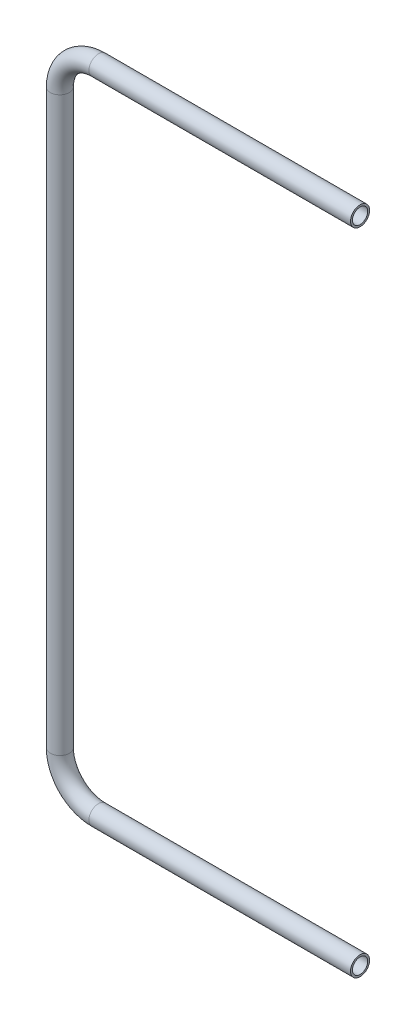
ISO-10303-21;
HEADER;
FILE_DESCRIPTION(('STEP AP214'),'2;1');
FILE_NAME('part.step','',(''),(''),'','','');
FILE_SCHEMA(('AUTOMOTIVE_DESIGN { 1 0 10303 214 1 1 1 1 }'));
ENDSEC;
DATA;
#1=APPLICATION_CONTEXT('core data for automotive mechanical design processes');
#2=APPLICATION_PROTOCOL_DEFINITION('international standard','automotive_design',2000,#1);
#3=PRODUCT_CONTEXT('',#1,'mechanical');
#4=PRODUCT('Part','Part','',(#3));
#5=PRODUCT_RELATED_PRODUCT_CATEGORY('part','',(#4));
#6=PRODUCT_DEFINITION_FORMATION('','',#4);
#7=PRODUCT_DEFINITION_CONTEXT('part definition',#1,'design');
#8=PRODUCT_DEFINITION('design','',#6,#7);
#9=PRODUCT_DEFINITION_SHAPE('','',#8);
#10=(LENGTH_UNIT() NAMED_UNIT(*) SI_UNIT(.MILLI.,.METRE.));
#11=(NAMED_UNIT(*) PLANE_ANGLE_UNIT() SI_UNIT($,.RADIAN.));
#12=(NAMED_UNIT(*) SI_UNIT($,.STERADIAN.) SOLID_ANGLE_UNIT());
#13=UNCERTAINTY_MEASURE_WITH_UNIT(LENGTH_MEASURE(1.E-05),#10,'distance_accuracy_value','');
#14=(GEOMETRIC_REPRESENTATION_CONTEXT(3) GLOBAL_UNCERTAINTY_ASSIGNED_CONTEXT((#13)) GLOBAL_UNIT_ASSIGNED_CONTEXT((#10,
#11,#12)) REPRESENTATION_CONTEXT('',''));
#15=CARTESIAN_POINT('',(0.,0.,0.));
#16=DIRECTION('',(0.,0.,1.));
#17=DIRECTION('',(1.,0.,0.));
#18=AXIS2_PLACEMENT_3D('',#15,#16,#17);
#19=CARTESIAN_POINT('',(0.,0.,0.));
#20=DIRECTION('',(-1.,0.,0.));
#21=DIRECTION('',(0.,-1.,0.));
#22=AXIS2_PLACEMENT_3D('',#19,#20,#21);
#23=CYLINDRICAL_SURFACE('',#22,16.7005);
#24=CARTESIAN_POINT('',(-457.2,0.,0.));
#25=DIRECTION('',(1.,0.,0.));
#26=DIRECTION('',(0.,0.,-1.));
#27=AXIS2_PLACEMENT_3D('',#24,#25,#26);
#28=CIRCLE('',#27,16.7005);
#29=CARTESIAN_POINT('',(-457.2,-16.7005000000001,0.));
#30=VERTEX_POINT('',#29);
#31=EDGE_CURVE('E118',#30,#30,#28,.T.);
#32=ORIENTED_EDGE('',*,*,#31,.T.);
#33=EDGE_LOOP('',(#32));
#34=FACE_BOUND('',#33,.T.);
#35=CARTESIAN_POINT('',(0.,0.,0.));
#36=DIRECTION('',(1.,0.,0.));
#37=DIRECTION('',(0.,0.,-1.));
#38=AXIS2_PLACEMENT_3D('',#35,#36,#37);
#39=CIRCLE('',#38,16.7005);
#40=CARTESIAN_POINT('',(0.,0.,-16.7005));
#41=VERTEX_POINT('',#40);
#42=EDGE_CURVE('E52',#41,#41,#39,.T.);
#43=ORIENTED_EDGE('',*,*,#42,.F.);
#44=EDGE_LOOP('',(#43));
#45=FACE_BOUND('',#44,.T.);
#46=ADVANCED_FACE('F37',(#34,#45),#23,.T.);
#47=CARTESIAN_POINT('',(-457.2,67.5004999999999,0.));
#48=DIRECTION('',(0.,0.,-1.));
#49=DIRECTION('',(-1.,0.,0.));
#50=AXIS2_PLACEMENT_3D('',#47,#48,#49);
#51=TOROIDAL_SURFACE('',#50,67.5005,16.7005);
#52=CARTESIAN_POINT('',(-524.7005,67.5004999999999,0.));
#53=DIRECTION('',(0.,-1.,0.));
#54=DIRECTION('',(0.,0.,-1.));
#55=AXIS2_PLACEMENT_3D('',#52,#53,#54);
#56=CIRCLE('',#55,16.7005);
#57=CARTESIAN_POINT('',(-541.401,67.5004999999999,0.));
#58=VERTEX_POINT('',#57);
#59=EDGE_CURVE('E121',#58,#58,#56,.T.);
#60=CARTESIAN_POINT('',(-457.2,67.5004999999999,0.));
#61=DIRECTION('',(0.,0.,-1.));
#62=DIRECTION('',(-1.,0.,0.));
#63=AXIS2_PLACEMENT_3D('',#60,#61,#62);
#64=CIRCLE('',#63,84.201);
#65=EDGE_CURVE('',#30,#58,#64,.T.);
#66=ORIENTED_EDGE('',*,*,#31,.F.);
#67=ORIENTED_EDGE('',*,*,#59,.T.);
#68=ORIENTED_EDGE('',*,*,#65,.T.);
#69=ORIENTED_EDGE('',*,*,#65,.F.);
#70=EDGE_LOOP('',(#66,#68,#67,#69));
#71=FACE_BOUND('',#70,.T.);
#72=ADVANCED_FACE('F142',(#71),#51,.T.);
#73=CARTESIAN_POINT('',(-524.7005,67.5004999999999,0.));
#74=DIRECTION('',(0.,1.,0.));
#75=DIRECTION('',(-1.,0.,0.));
#76=AXIS2_PLACEMENT_3D('',#73,#74,#75);
#77=CYLINDRICAL_SURFACE('',#76,16.7005);
#78=CARTESIAN_POINT('',(-524.7005,1067.562,0.));
#79=DIRECTION('',(0.,-1.,0.));
#80=DIRECTION('',(0.,0.,-1.));
#81=AXIS2_PLACEMENT_3D('',#78,#79,#80);
#82=CIRCLE('',#81,16.7005);
#83=CARTESIAN_POINT('',(-541.401,1067.562,0.));
#84=VERTEX_POINT('',#83);
#85=EDGE_CURVE('E123',#84,#84,#82,.T.);
#86=ORIENTED_EDGE('',*,*,#85,.T.);
#87=EDGE_LOOP('',(#86));
#88=FACE_BOUND('',#87,.T.);
#89=ORIENTED_EDGE('',*,*,#59,.F.);
#90=EDGE_LOOP('',(#89));
#91=FACE_BOUND('',#90,.T.);
#92=ADVANCED_FACE('F138',(#88,#91),#77,.T.);
#93=CARTESIAN_POINT('',(-457.2,1067.562,0.));
#94=DIRECTION('',(0.,0.,-1.));
#95=DIRECTION('',(-1.,0.,0.));
#96=AXIS2_PLACEMENT_3D('',#93,#94,#95);
#97=TOROIDAL_SURFACE('',#96,67.5005,16.7005);
#98=CARTESIAN_POINT('',(-457.2,1135.0625,0.));
#99=DIRECTION('',(-1.,0.,0.));
#100=DIRECTION('',(0.,0.,-1.));
#101=AXIS2_PLACEMENT_3D('',#98,#99,#100);
#102=CIRCLE('',#101,16.7005);
#103=CARTESIAN_POINT('',(-457.2,1151.763,0.));
#104=VERTEX_POINT('',#103);
#105=EDGE_CURVE('E41',#104,#104,#102,.T.);
#106=CARTESIAN_POINT('',(-457.2,1067.562,0.));
#107=DIRECTION('',(0.,0.,-1.));
#108=DIRECTION('',(-1.,0.,0.));
#109=AXIS2_PLACEMENT_3D('',#106,#107,#108);
#110=CIRCLE('',#109,84.201);
#111=EDGE_CURVE('',#84,#104,#110,.T.);
#112=ORIENTED_EDGE('',*,*,#85,.F.);
#113=ORIENTED_EDGE('',*,*,#105,.T.);
#114=ORIENTED_EDGE('',*,*,#111,.T.);
#115=ORIENTED_EDGE('',*,*,#111,.F.);
#116=EDGE_LOOP('',(#112,#114,#113,#115));
#117=FACE_BOUND('',#116,.T.);
#118=ADVANCED_FACE('F130',(#117),#97,.T.);
#119=CARTESIAN_POINT('',(-457.2,1135.0625,0.));
#120=DIRECTION('',(1.,0.,0.));
#121=DIRECTION('',(0.,1.,0.));
#122=AXIS2_PLACEMENT_3D('',#119,#120,#121);
#123=CYLINDRICAL_SURFACE('',#122,16.7005);
#124=CARTESIAN_POINT('',(-3.33066907387547E-13,1135.0625,0.));
#125=DIRECTION('',(-1.,0.,0.));
#126=DIRECTION('',(0.,0.,-1.));
#127=AXIS2_PLACEMENT_3D('',#124,#125,#126);
#128=CIRCLE('',#127,16.7005);
#129=CARTESIAN_POINT('',(-3.33066907387547E-13,1135.0625,-16.7005));
#130=VERTEX_POINT('',#129);
#131=EDGE_CURVE('E57',#130,#130,#128,.T.);
#132=ORIENTED_EDGE('',*,*,#131,.T.);
#133=EDGE_LOOP('',(#132));
#134=FACE_BOUND('',#133,.T.);
#135=ORIENTED_EDGE('',*,*,#105,.F.);
#136=EDGE_LOOP('',(#135));
#137=FACE_BOUND('',#136,.T.);
#138=ADVANCED_FACE('F39',(#134,#137),#123,.T.);
#139=CARTESIAN_POINT('',(0.,0.,0.));
#140=DIRECTION('',(1.,0.,0.));
#141=DIRECTION('',(0.,0.,-1.));
#142=AXIS2_PLACEMENT_3D('',#139,#140,#141);
#143=PLANE('',#142);
#144=CARTESIAN_POINT('',(0.,0.,0.));
#145=DIRECTION('',(1.,0.,0.));
#146=DIRECTION('',(0.,0.,-1.));
#147=AXIS2_PLACEMENT_3D('',#144,#145,#146);
#148=CIRCLE('',#147,13.335);
#149=CARTESIAN_POINT('',(0.,0.,-13.335));
#150=VERTEX_POINT('',#149);
#151=EDGE_CURVE('E105',#150,#150,#148,.F.);
#152=ORIENTED_EDGE('',*,*,#151,.T.);
#153=EDGE_LOOP('',(#152));
#154=FACE_BOUND('',#153,.T.);
#155=ORIENTED_EDGE('',*,*,#42,.T.);
#156=EDGE_LOOP('',(#155));
#157=FACE_BOUND('',#156,.T.);
#158=ADVANCED_FACE('F70',(#154,#157),#143,.T.);
#159=CARTESIAN_POINT('',(-3.33066907387547E-13,1135.0625,0.));
#160=DIRECTION('',(-1.,0.,0.));
#161=DIRECTION('',(0.,0.,-1.));
#162=AXIS2_PLACEMENT_3D('',#159,#160,#161);
#163=PLANE('',#162);
#164=CARTESIAN_POINT('',(-3.33066907387547E-13,1135.0625,0.));
#165=DIRECTION('',(-1.,0.,0.));
#166=DIRECTION('',(0.,0.,-1.));
#167=AXIS2_PLACEMENT_3D('',#164,#165,#166);
#168=CIRCLE('',#167,13.335);
#169=CARTESIAN_POINT('',(-3.33066907387547E-13,1135.0625,-13.335));
#170=VERTEX_POINT('',#169);
#171=EDGE_CURVE('E11',#170,#170,#168,.F.);
#172=ORIENTED_EDGE('',*,*,#171,.F.);
#173=EDGE_LOOP('',(#172));
#174=FACE_BOUND('',#173,.T.);
#175=ORIENTED_EDGE('',*,*,#131,.F.);
#176=EDGE_LOOP('',(#175));
#177=FACE_BOUND('',#176,.T.);
#178=ADVANCED_FACE('F67',(#174,#177),#163,.F.);
#179=CARTESIAN_POINT('',(0.,0.,0.));
#180=DIRECTION('',(-1.,0.,0.));
#181=DIRECTION('',(0.,-1.,0.));
#182=AXIS2_PLACEMENT_3D('',#179,#180,#181);
#183=CYLINDRICAL_SURFACE('',#182,13.335);
#184=CARTESIAN_POINT('',(-457.2,0.,0.));
#185=DIRECTION('',(1.,0.,0.));
#186=DIRECTION('',(0.,0.,-1.));
#187=AXIS2_PLACEMENT_3D('',#184,#185,#186);
#188=CIRCLE('',#187,13.335);
#189=CARTESIAN_POINT('',(-457.2,-13.3350000000001,0.));
#190=VERTEX_POINT('',#189);
#191=EDGE_CURVE('E104',#190,#190,#188,.F.);
#192=ORIENTED_EDGE('',*,*,#191,.T.);
#193=EDGE_LOOP('',(#192));
#194=FACE_BOUND('',#193,.T.);
#195=ORIENTED_EDGE('',*,*,#151,.F.);
#196=EDGE_LOOP('',(#195));
#197=FACE_BOUND('',#196,.T.);
#198=ADVANCED_FACE('F69',(#194,#197),#183,.F.);
#199=CARTESIAN_POINT('',(-457.2,67.5004999999999,0.));
#200=DIRECTION('',(0.,0.,-1.));
#201=DIRECTION('',(-1.,0.,0.));
#202=AXIS2_PLACEMENT_3D('',#199,#200,#201);
#203=TOROIDAL_SURFACE('',#202,67.5005,13.335);
#204=CARTESIAN_POINT('',(-524.7005,67.5004999999999,0.));
#205=DIRECTION('',(0.,-1.,0.));
#206=DIRECTION('',(0.,0.,-1.));
#207=AXIS2_PLACEMENT_3D('',#204,#205,#206);
#208=CIRCLE('',#207,13.335);
#209=CARTESIAN_POINT('',(-538.0355,67.5004999999999,0.));
#210=VERTEX_POINT('',#209);
#211=EDGE_CURVE('E101',#210,#210,#208,.F.);
#212=CARTESIAN_POINT('',(-457.2,67.5004999999999,0.));
#213=DIRECTION('',(0.,0.,-1.));
#214=DIRECTION('',(-1.,0.,0.));
#215=AXIS2_PLACEMENT_3D('',#212,#213,#214);
#216=CIRCLE('',#215,80.8355);
#217=EDGE_CURVE('',#190,#210,#216,.T.);
#218=ORIENTED_EDGE('',*,*,#191,.F.);
#219=ORIENTED_EDGE('',*,*,#211,.T.);
#220=ORIENTED_EDGE('',*,*,#217,.T.);
#221=ORIENTED_EDGE('',*,*,#217,.F.);
#222=EDGE_LOOP('',(#218,#220,#219,#221));
#223=FACE_BOUND('',#222,.T.);
#224=ADVANCED_FACE('F76',(#223),#203,.F.);
#225=CARTESIAN_POINT('',(-524.7005,67.5004999999999,0.));
#226=DIRECTION('',(0.,1.,0.));
#227=DIRECTION('',(-1.,0.,0.));
#228=AXIS2_PLACEMENT_3D('',#225,#226,#227);
#229=CYLINDRICAL_SURFACE('',#228,13.335);
#230=CARTESIAN_POINT('',(-524.7005,1067.562,0.));
#231=DIRECTION('',(0.,-1.,0.));
#232=DIRECTION('',(0.,0.,-1.));
#233=AXIS2_PLACEMENT_3D('',#230,#231,#232);
#234=CIRCLE('',#233,13.335);
#235=CARTESIAN_POINT('',(-538.0355,1067.562,0.));
#236=VERTEX_POINT('',#235);
#237=EDGE_CURVE('E107',#236,#236,#234,.F.);
#238=ORIENTED_EDGE('',*,*,#237,.T.);
#239=EDGE_LOOP('',(#238));
#240=FACE_BOUND('',#239,.T.);
#241=ORIENTED_EDGE('',*,*,#211,.F.);
#242=EDGE_LOOP('',(#241));
#243=FACE_BOUND('',#242,.T.);
#244=ADVANCED_FACE('F87',(#240,#243),#229,.F.);
#245=CARTESIAN_POINT('',(-457.2,1067.562,0.));
#246=DIRECTION('',(0.,0.,-1.));
#247=DIRECTION('',(-1.,0.,0.));
#248=AXIS2_PLACEMENT_3D('',#245,#246,#247);
#249=TOROIDAL_SURFACE('',#248,67.5005,13.335);
#250=CARTESIAN_POINT('',(-457.2,1135.0625,0.));
#251=DIRECTION('',(-1.,0.,0.));
#252=DIRECTION('',(0.,0.,-1.));
#253=AXIS2_PLACEMENT_3D('',#250,#251,#252);
#254=CIRCLE('',#253,13.335);
#255=CARTESIAN_POINT('',(-457.2,1148.3975,0.));
#256=VERTEX_POINT('',#255);
#257=EDGE_CURVE('E46',#256,#256,#254,.F.);
#258=CARTESIAN_POINT('',(-457.2,1067.562,0.));
#259=DIRECTION('',(0.,0.,-1.));
#260=DIRECTION('',(-1.,0.,0.));
#261=AXIS2_PLACEMENT_3D('',#258,#259,#260);
#262=CIRCLE('',#261,80.8355);
#263=EDGE_CURVE('',#236,#256,#262,.T.);
#264=ORIENTED_EDGE('',*,*,#237,.F.);
#265=ORIENTED_EDGE('',*,*,#257,.T.);
#266=ORIENTED_EDGE('',*,*,#263,.T.);
#267=ORIENTED_EDGE('',*,*,#263,.F.);
#268=EDGE_LOOP('',(#264,#266,#265,#267));
#269=FACE_BOUND('',#268,.T.);
#270=ADVANCED_FACE('F83',(#269),#249,.F.);
#271=CARTESIAN_POINT('',(-457.2,1135.0625,0.));
#272=DIRECTION('',(1.,0.,0.));
#273=DIRECTION('',(0.,1.,0.));
#274=AXIS2_PLACEMENT_3D('',#271,#272,#273);
#275=CYLINDRICAL_SURFACE('',#274,13.335);
#276=ORIENTED_EDGE('',*,*,#171,.T.);
#277=EDGE_LOOP('',(#276));
#278=FACE_BOUND('',#277,.T.);
#279=ORIENTED_EDGE('',*,*,#257,.F.);
#280=EDGE_LOOP('',(#279));
#281=FACE_BOUND('',#280,.T.);
#282=ADVANCED_FACE('F64',(#278,#281),#275,.F.);
#283=CLOSED_SHELL('',(#46,#72,#92,#118,#138,#158,#178,#198,#224,#244,#270,#282));
#284=MANIFOLD_SOLID_BREP('B2',#283);
#285=ADVANCED_BREP_SHAPE_REPRESENTATION('',(#18,#284),#14);
#286=SHAPE_DEFINITION_REPRESENTATION(#9,#285);
ENDSEC;
END-ISO-10303-21;
